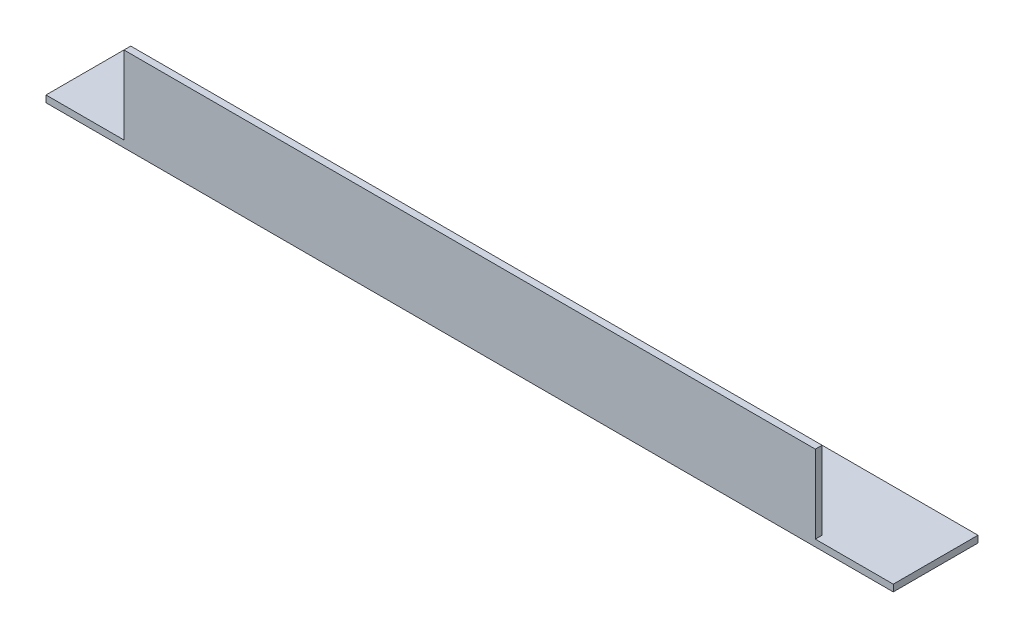
ISO-10303-21;
HEADER;
FILE_DESCRIPTION(('STEP AP214'),'2;1');
FILE_NAME('part.step','',(''),(''),'','','');
FILE_SCHEMA(('AUTOMOTIVE_DESIGN { 1 0 10303 214 1 1 1 1 }'));
ENDSEC;
DATA;
#1=APPLICATION_CONTEXT('core data for automotive mechanical design processes');
#2=APPLICATION_PROTOCOL_DEFINITION('international standard','automotive_design',2000,#1);
#3=PRODUCT_CONTEXT('',#1,'mechanical');
#4=PRODUCT('Part','Part','',(#3));
#5=PRODUCT_RELATED_PRODUCT_CATEGORY('part','',(#4));
#6=PRODUCT_DEFINITION_FORMATION('','',#4);
#7=PRODUCT_DEFINITION_CONTEXT('part definition',#1,'design');
#8=PRODUCT_DEFINITION('design','',#6,#7);
#9=PRODUCT_DEFINITION_SHAPE('','',#8);
#10=(LENGTH_UNIT() NAMED_UNIT(*) SI_UNIT(.MILLI.,.METRE.));
#11=(NAMED_UNIT(*) PLANE_ANGLE_UNIT() SI_UNIT($,.RADIAN.));
#12=(NAMED_UNIT(*) SI_UNIT($,.STERADIAN.) SOLID_ANGLE_UNIT());
#13=UNCERTAINTY_MEASURE_WITH_UNIT(LENGTH_MEASURE(1.E-05),#10,'distance_accuracy_value','');
#14=(GEOMETRIC_REPRESENTATION_CONTEXT(3) GLOBAL_UNCERTAINTY_ASSIGNED_CONTEXT((#13)) GLOBAL_UNIT_ASSIGNED_CONTEXT((#10,
#11,#12)) REPRESENTATION_CONTEXT('',''));
#15=CARTESIAN_POINT('',(0.,0.,0.));
#16=DIRECTION('',(0.,0.,1.));
#17=DIRECTION('',(1.,0.,0.));
#18=AXIS2_PLACEMENT_3D('',#15,#16,#17);
#19=CARTESIAN_POINT('',(250.,0.,0.));
#20=DIRECTION('',(0.,1.,0.));
#21=DIRECTION('',(0.,0.,1.));
#22=AXIS2_PLACEMENT_3D('',#19,#20,#21);
#23=PLANE('',#22);
#24=DIRECTION('',(0.,0.,-1.));
#25=VECTOR('',#24,1.);
#26=CARTESIAN_POINT('',(0.,0.,0.));
#27=LINE('',#26,#25);
#28=CARTESIAN_POINT('',(0.,0.,0.));
#29=VERTEX_POINT('',#28);
#30=CARTESIAN_POINT('',(0.,0.,-25.));
#31=VERTEX_POINT('',#30);
#32=EDGE_CURVE('E124',#29,#31,#27,.T.);
#33=ORIENTED_EDGE('',*,*,#32,.T.);
#34=DIRECTION('',(-1.,0.,0.));
#35=VECTOR('',#34,1.);
#36=CARTESIAN_POINT('',(250.,0.,-25.));
#37=LINE('',#36,#35);
#38=CARTESIAN_POINT('',(250.,0.,-25.));
#39=VERTEX_POINT('',#38);
#40=EDGE_CURVE('E11',#39,#31,#37,.T.);
#41=ORIENTED_EDGE('',*,*,#40,.F.);
#42=DIRECTION('',(0.,0.,-1.));
#43=VECTOR('',#42,1.);
#44=CARTESIAN_POINT('',(250.,0.,0.));
#45=LINE('',#44,#43);
#46=CARTESIAN_POINT('',(250.,0.,0.));
#47=VERTEX_POINT('',#46);
#48=EDGE_CURVE('E76',#47,#39,#45,.T.);
#49=ORIENTED_EDGE('',*,*,#48,.F.);
#50=DIRECTION('',(-1.,0.,0.));
#51=VECTOR('',#50,1.);
#52=CARTESIAN_POINT('',(250.,0.,0.));
#53=LINE('',#52,#51);
#54=EDGE_CURVE('E130',#47,#29,#53,.T.);
#55=ORIENTED_EDGE('',*,*,#54,.T.);
#56=EDGE_LOOP('',(#33,#41,#49,#55));
#57=FACE_BOUND('',#56,.T.);
#58=ADVANCED_FACE('F36',(#57),#23,.F.);
#59=CARTESIAN_POINT('',(250.,2.,-25.));
#60=DIRECTION('',(0.,0.,-1.));
#61=DIRECTION('',(-1.,0.,0.));
#62=AXIS2_PLACEMENT_3D('',#59,#60,#61);
#63=PLANE('',#62);
#64=DIRECTION('',(0.,-1.,0.));
#65=VECTOR('',#64,1.);
#66=CARTESIAN_POINT('',(0.,2.,-25.));
#67=LINE('',#66,#65);
#68=CARTESIAN_POINT('',(0.,2.,-25.));
#69=VERTEX_POINT('',#68);
#70=EDGE_CURVE('E115',#69,#31,#67,.T.);
#71=ORIENTED_EDGE('',*,*,#70,.F.);
#72=DIRECTION('',(-1.,0.,0.));
#73=VECTOR('',#72,1.);
#74=CARTESIAN_POINT('',(250.,2.,-25.));
#75=LINE('',#74,#73);
#76=CARTESIAN_POINT('',(250.,2.,-25.));
#77=VERTEX_POINT('',#76);
#78=EDGE_CURVE('E43',#77,#69,#75,.T.);
#79=ORIENTED_EDGE('',*,*,#78,.F.);
#80=DIRECTION('',(0.,-1.,0.));
#81=VECTOR('',#80,1.);
#82=CARTESIAN_POINT('',(250.,2.,-25.));
#83=LINE('',#82,#81);
#84=EDGE_CURVE('E126',#77,#39,#83,.T.);
#85=ORIENTED_EDGE('',*,*,#84,.T.);
#86=ORIENTED_EDGE('',*,*,#40,.T.);
#87=EDGE_LOOP('',(#71,#79,#85,#86));
#88=FACE_BOUND('',#87,.T.);
#89=ADVANCED_FACE('F171',(#88),#63,.T.);
#90=CARTESIAN_POINT('',(250.,2.,0.));
#91=DIRECTION('',(0.,1.,0.));
#92=DIRECTION('',(0.,0.,1.));
#93=AXIS2_PLACEMENT_3D('',#90,#91,#92);
#94=PLANE('',#93);
#95=ORIENTED_EDGE('',*,*,#78,.T.);
#96=DIRECTION('',(0.,0.,-1.));
#97=VECTOR('',#96,1.);
#98=CARTESIAN_POINT('',(0.,2.,0.));
#99=LINE('',#98,#97);
#100=CARTESIAN_POINT('',(0.,2.,0.));
#101=VERTEX_POINT('',#100);
#102=EDGE_CURVE('E107',#101,#69,#99,.T.);
#103=ORIENTED_EDGE('',*,*,#102,.F.);
#104=DIRECTION('',(1.,0.,0.));
#105=VECTOR('',#104,1.);
#106=CARTESIAN_POINT('',(0.,2.,0.));
#107=LINE('',#106,#105);
#108=CARTESIAN_POINT('',(23.,2.00000000000001,0.));
#109=VERTEX_POINT('',#108);
#110=EDGE_CURVE('E110',#101,#109,#107,.T.);
#111=ORIENTED_EDGE('',*,*,#110,.T.);
#112=DIRECTION('',(0.,0.,1.));
#113=VECTOR('',#112,1.);
#114=CARTESIAN_POINT('',(23.,2.00000000000001,-25.));
#115=LINE('',#114,#113);
#116=CARTESIAN_POINT('',(23.,2.00000000000001,-2.));
#117=VERTEX_POINT('',#116);
#118=EDGE_CURVE('E149',#117,#109,#115,.T.);
#119=ORIENTED_EDGE('',*,*,#118,.F.);
#120=DIRECTION('',(-1.,0.,0.));
#121=VECTOR('',#120,1.);
#122=CARTESIAN_POINT('',(250.,2.,-2.));
#123=LINE('',#122,#121);
#124=CARTESIAN_POINT('',(227.,2.00000000000003,-2.));
#125=VERTEX_POINT('',#124);
#126=EDGE_CURVE('E137',#125,#117,#123,.T.);
#127=ORIENTED_EDGE('',*,*,#126,.F.);
#128=DIRECTION('',(0.,0.,1.));
#129=VECTOR('',#128,1.);
#130=CARTESIAN_POINT('',(227.,2.00000000000003,-25.));
#131=LINE('',#130,#129);
#132=CARTESIAN_POINT('',(227.,2.00000000000003,0.));
#133=VERTEX_POINT('',#132);
#134=EDGE_CURVE('E147',#125,#133,#131,.T.);
#135=ORIENTED_EDGE('',*,*,#134,.T.);
#136=DIRECTION('',(1.,0.,0.));
#137=VECTOR('',#136,1.);
#138=CARTESIAN_POINT('',(250.,2.00000000000003,0.));
#139=LINE('',#138,#137);
#140=CARTESIAN_POINT('',(250.,2.00000000000003,0.));
#141=VERTEX_POINT('',#140);
#142=EDGE_CURVE('E160',#133,#141,#139,.T.);
#143=ORIENTED_EDGE('',*,*,#142,.T.);
#144=DIRECTION('',(0.,0.,-1.));
#145=VECTOR('',#144,1.);
#146=CARTESIAN_POINT('',(250.,2.,0.));
#147=LINE('',#146,#145);
#148=EDGE_CURVE('E50',#141,#77,#147,.T.);
#149=ORIENTED_EDGE('',*,*,#148,.T.);
#150=EDGE_LOOP('',(#95,#103,#111,#119,#127,#135,#143,#149));
#151=FACE_BOUND('',#150,.T.);
#152=ADVANCED_FACE('F108',(#151),#94,.T.);
#153=CARTESIAN_POINT('',(250.,25.,-2.));
#154=DIRECTION('',(0.,0.,-1.));
#155=DIRECTION('',(0.,1.,0.));
#156=AXIS2_PLACEMENT_3D('',#153,#154,#155);
#157=PLANE('',#156);
#158=DIRECTION('',(0.,-1.,0.));
#159=VECTOR('',#158,1.);
#160=CARTESIAN_POINT('',(23.,25.,-2.));
#161=LINE('',#160,#159);
#162=CARTESIAN_POINT('',(23.,25.,-2.));
#163=VERTEX_POINT('',#162);
#164=EDGE_CURVE('E145',#163,#117,#161,.T.);
#165=ORIENTED_EDGE('',*,*,#164,.F.);
#166=DIRECTION('',(-1.,0.,0.));
#167=VECTOR('',#166,1.);
#168=CARTESIAN_POINT('',(250.,25.,-2.));
#169=LINE('',#168,#167);
#170=CARTESIAN_POINT('',(227.,25.,-2.));
#171=VERTEX_POINT('',#170);
#172=EDGE_CURVE('E134',#171,#163,#169,.T.);
#173=ORIENTED_EDGE('',*,*,#172,.F.);
#174=DIRECTION('',(0.,1.,0.));
#175=VECTOR('',#174,1.);
#176=CARTESIAN_POINT('',(227.,25.,-2.));
#177=LINE('',#176,#175);
#178=EDGE_CURVE('E146',#125,#171,#177,.T.);
#179=ORIENTED_EDGE('',*,*,#178,.F.);
#180=ORIENTED_EDGE('',*,*,#126,.T.);
#181=EDGE_LOOP('',(#165,#173,#179,#180));
#182=FACE_BOUND('',#181,.T.);
#183=ADVANCED_FACE('F143',(#182),#157,.T.);
#184=CARTESIAN_POINT('',(250.,25.,0.));
#185=DIRECTION('',(0.,1.,0.));
#186=DIRECTION('',(0.,0.,1.));
#187=AXIS2_PLACEMENT_3D('',#184,#185,#186);
#188=PLANE('',#187);
#189=DIRECTION('',(0.,0.,1.));
#190=VECTOR('',#189,1.);
#191=CARTESIAN_POINT('',(23.,25.,-25.));
#192=LINE('',#191,#190);
#193=CARTESIAN_POINT('',(23.,25.,0.));
#194=VERTEX_POINT('',#193);
#195=EDGE_CURVE('E151',#163,#194,#192,.T.);
#196=ORIENTED_EDGE('',*,*,#195,.T.);
#197=DIRECTION('',(-1.,0.,0.));
#198=VECTOR('',#197,1.);
#199=CARTESIAN_POINT('',(250.,25.,0.));
#200=LINE('',#199,#198);
#201=CARTESIAN_POINT('',(227.,25.,0.));
#202=VERTEX_POINT('',#201);
#203=EDGE_CURVE('E132',#202,#194,#200,.T.);
#204=ORIENTED_EDGE('',*,*,#203,.F.);
#205=DIRECTION('',(0.,0.,1.));
#206=VECTOR('',#205,1.);
#207=CARTESIAN_POINT('',(227.,25.,-25.));
#208=LINE('',#207,#206);
#209=EDGE_CURVE('E162',#171,#202,#208,.T.);
#210=ORIENTED_EDGE('',*,*,#209,.F.);
#211=ORIENTED_EDGE('',*,*,#172,.T.);
#212=EDGE_LOOP('',(#196,#204,#210,#211));
#213=FACE_BOUND('',#212,.T.);
#214=ADVANCED_FACE('F179',(#213),#188,.T.);
#215=CARTESIAN_POINT('',(250.,25.,0.));
#216=DIRECTION('',(0.,0.,-1.));
#217=DIRECTION('',(0.,1.,0.));
#218=AXIS2_PLACEMENT_3D('',#215,#216,#217);
#219=PLANE('',#218);
#220=ORIENTED_EDGE('',*,*,#203,.T.);
#221=DIRECTION('',(0.,1.,0.));
#222=VECTOR('',#221,1.);
#223=CARTESIAN_POINT('',(23.,25.,0.));
#224=LINE('',#223,#222);
#225=EDGE_CURVE('E119',#109,#194,#224,.T.);
#226=ORIENTED_EDGE('',*,*,#225,.F.);
#227=ORIENTED_EDGE('',*,*,#110,.F.);
#228=DIRECTION('',(0.,-1.,0.));
#229=VECTOR('',#228,1.);
#230=CARTESIAN_POINT('',(0.,25.,0.));
#231=LINE('',#230,#229);
#232=EDGE_CURVE('E73',#101,#29,#231,.T.);
#233=ORIENTED_EDGE('',*,*,#232,.T.);
#234=ORIENTED_EDGE('',*,*,#54,.F.);
#235=DIRECTION('',(0.,-1.,0.));
#236=VECTOR('',#235,1.);
#237=CARTESIAN_POINT('',(250.,25.,0.));
#238=LINE('',#237,#236);
#239=EDGE_CURVE('E56',#141,#47,#238,.T.);
#240=ORIENTED_EDGE('',*,*,#239,.F.);
#241=ORIENTED_EDGE('',*,*,#142,.F.);
#242=DIRECTION('',(0.,-1.,0.));
#243=VECTOR('',#242,1.);
#244=CARTESIAN_POINT('',(227.,25.,0.));
#245=LINE('',#244,#243);
#246=EDGE_CURVE('E158',#202,#133,#245,.T.);
#247=ORIENTED_EDGE('',*,*,#246,.F.);
#248=EDGE_LOOP('',(#220,#226,#227,#233,#234,#240,#241,#247));
#249=FACE_BOUND('',#248,.T.);
#250=ADVANCED_FACE('F118',(#249),#219,.F.);
#251=CARTESIAN_POINT('',(250.,0.,0.));
#252=DIRECTION('',(-1.,0.,0.));
#253=DIRECTION('',(0.,0.,1.));
#254=AXIS2_PLACEMENT_3D('',#251,#252,#253);
#255=PLANE('',#254);
#256=ORIENTED_EDGE('',*,*,#148,.F.);
#257=ORIENTED_EDGE('',*,*,#239,.T.);
#258=ORIENTED_EDGE('',*,*,#48,.T.);
#259=ORIENTED_EDGE('',*,*,#84,.F.);
#260=EDGE_LOOP('',(#256,#257,#258,#259));
#261=FACE_BOUND('',#260,.T.);
#262=ADVANCED_FACE('F203',(#261),#255,.F.);
#263=CARTESIAN_POINT('',(0.,0.,0.));
#264=DIRECTION('',(-1.,0.,0.));
#265=DIRECTION('',(0.,0.,1.));
#266=AXIS2_PLACEMENT_3D('',#263,#264,#265);
#267=PLANE('',#266);
#268=ORIENTED_EDGE('',*,*,#232,.F.);
#269=ORIENTED_EDGE('',*,*,#102,.T.);
#270=ORIENTED_EDGE('',*,*,#70,.T.);
#271=ORIENTED_EDGE('',*,*,#32,.F.);
#272=EDGE_LOOP('',(#268,#269,#270,#271));
#273=FACE_BOUND('',#272,.T.);
#274=ADVANCED_FACE('F122',(#273),#267,.T.);
#275=CARTESIAN_POINT('',(227.,25.,-25.));
#276=DIRECTION('',(-1.,0.,0.));
#277=DIRECTION('',(0.,0.,1.));
#278=AXIS2_PLACEMENT_3D('',#275,#276,#277);
#279=PLANE('',#278);
#280=ORIENTED_EDGE('',*,*,#178,.T.);
#281=ORIENTED_EDGE('',*,*,#209,.T.);
#282=ORIENTED_EDGE('',*,*,#246,.T.);
#283=ORIENTED_EDGE('',*,*,#134,.F.);
#284=EDGE_LOOP('',(#280,#281,#282,#283));
#285=FACE_BOUND('',#284,.T.);
#286=ADVANCED_FACE('F182',(#285),#279,.F.);
#287=CARTESIAN_POINT('',(23.,25.,-25.));
#288=DIRECTION('',(1.,0.,0.));
#289=DIRECTION('',(0.,0.,-1.));
#290=AXIS2_PLACEMENT_3D('',#287,#288,#289);
#291=PLANE('',#290);
#292=ORIENTED_EDGE('',*,*,#164,.T.);
#293=ORIENTED_EDGE('',*,*,#118,.T.);
#294=ORIENTED_EDGE('',*,*,#225,.T.);
#295=ORIENTED_EDGE('',*,*,#195,.F.);
#296=EDGE_LOOP('',(#292,#293,#294,#295));
#297=FACE_BOUND('',#296,.T.);
#298=ADVANCED_FACE('F180',(#297),#291,.F.);
#299=CLOSED_SHELL('',(#58,#89,#152,#183,#214,#250,#262,#274,#286,#298));
#300=MANIFOLD_SOLID_BREP('B2',#299);
#301=ADVANCED_BREP_SHAPE_REPRESENTATION('',(#18,#300),#14);
#302=SHAPE_DEFINITION_REPRESENTATION(#9,#301);
ENDSEC;
END-ISO-10303-21;
